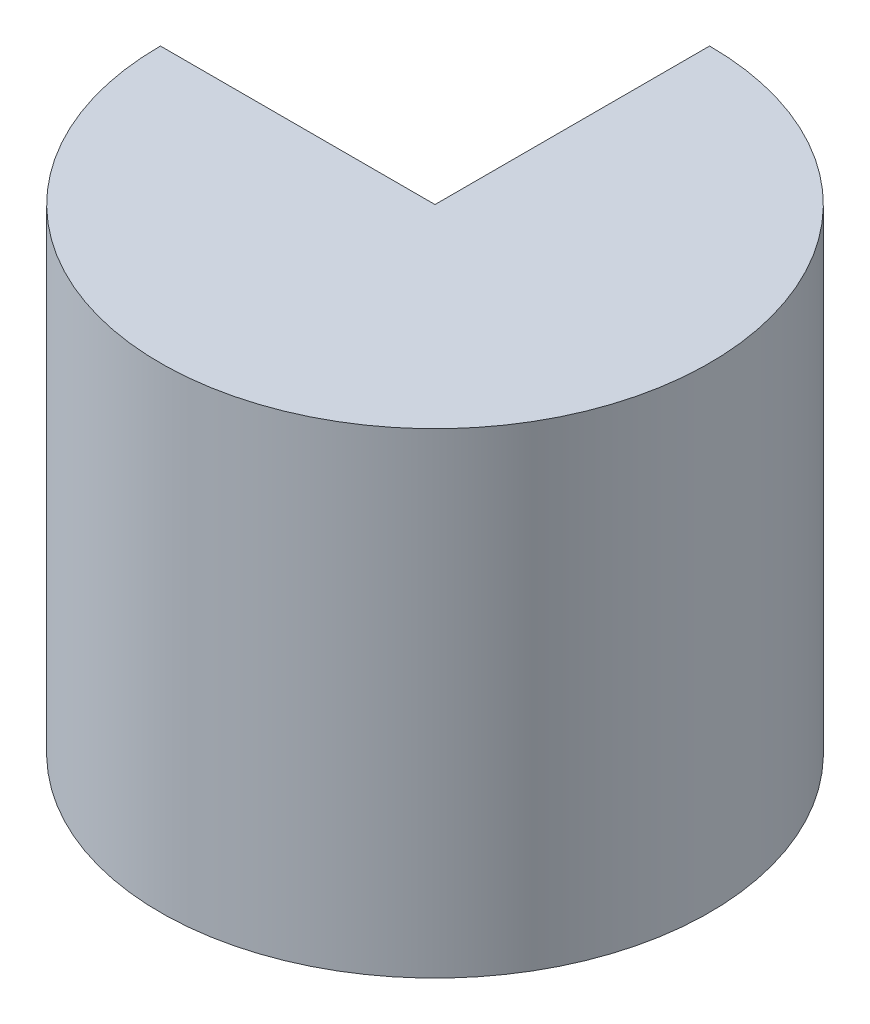
ISO-10303-21;
HEADER;
FILE_DESCRIPTION(('STEP AP214'),'2;1');
FILE_NAME('part.step','',(''),(''),'','','');
FILE_SCHEMA(('AUTOMOTIVE_DESIGN { 1 0 10303 214 1 1 1 1 }'));
ENDSEC;
DATA;
#1=APPLICATION_CONTEXT('core data for automotive mechanical design processes');
#2=APPLICATION_PROTOCOL_DEFINITION('international standard','automotive_design',2000,#1);
#3=PRODUCT_CONTEXT('',#1,'mechanical');
#4=PRODUCT('Part','Part','',(#3));
#5=PRODUCT_RELATED_PRODUCT_CATEGORY('part','',(#4));
#6=PRODUCT_DEFINITION_FORMATION('','',#4);
#7=PRODUCT_DEFINITION_CONTEXT('part definition',#1,'design');
#8=PRODUCT_DEFINITION('design','',#6,#7);
#9=PRODUCT_DEFINITION_SHAPE('','',#8);
#10=(LENGTH_UNIT() NAMED_UNIT(*) SI_UNIT(.MILLI.,.METRE.));
#11=(NAMED_UNIT(*) PLANE_ANGLE_UNIT() SI_UNIT($,.RADIAN.));
#12=(NAMED_UNIT(*) SI_UNIT($,.STERADIAN.) SOLID_ANGLE_UNIT());
#13=UNCERTAINTY_MEASURE_WITH_UNIT(LENGTH_MEASURE(1.E-05),#10,'distance_accuracy_value','');
#14=(GEOMETRIC_REPRESENTATION_CONTEXT(3) GLOBAL_UNCERTAINTY_ASSIGNED_CONTEXT((#13)) GLOBAL_UNIT_ASSIGNED_CONTEXT((#10,
#11,#12)) REPRESENTATION_CONTEXT('',''));
#15=CARTESIAN_POINT('',(0.,0.,0.));
#16=DIRECTION('',(0.,0.,1.));
#17=DIRECTION('',(1.,0.,0.));
#18=AXIS2_PLACEMENT_3D('',#15,#16,#17);
#19=CARTESIAN_POINT('',(-25.654,45.0234349741081,-2.68711386800045E-13));
#20=DIRECTION('',(0.,-1.,0.));
#21=DIRECTION('',(0.,0.,-1.));
#22=AXIS2_PLACEMENT_3D('',#19,#20,#21);
#23=PLANE('',#22);
#24=CARTESIAN_POINT('',(0.,45.0234349741081,0.));
#25=DIRECTION('',(0.,1.,0.));
#26=DIRECTION('',(0.,0.,1.));
#27=AXIS2_PLACEMENT_3D('',#24,#25,#26);
#28=CIRCLE('',#27,25.654);
#29=CARTESIAN_POINT('',(-25.654,45.0234349741081,-2.68711386800045E-13));
#30=VERTEX_POINT('',#29);
#31=CARTESIAN_POINT('',(0.,45.0234349741081,-25.654));
#32=VERTEX_POINT('',#31);
#33=EDGE_CURVE('E11',#30,#32,#28,.T.);
#34=ORIENTED_EDGE('',*,*,#33,.T.);
#35=DIRECTION('',(0.,0.,1.));
#36=VECTOR('',#35,1.);
#37=CARTESIAN_POINT('',(0.,45.0234349741081,-25.654));
#38=LINE('',#37,#36);
#39=CARTESIAN_POINT('',(0.,45.0234349741081,0.));
#40=VERTEX_POINT('',#39);
#41=EDGE_CURVE('E53',#32,#40,#38,.T.);
#42=ORIENTED_EDGE('',*,*,#41,.T.);
#43=DIRECTION('',(1.,0.,0.));
#44=VECTOR('',#43,1.);
#45=CARTESIAN_POINT('',(-25.654,45.0234349741081,-2.68711386800045E-13));
#46=LINE('',#45,#44);
#47=EDGE_CURVE('E88',#30,#40,#46,.T.);
#48=ORIENTED_EDGE('',*,*,#47,.F.);
#49=EDGE_LOOP('',(#34,#42,#48));
#50=FACE_BOUND('',#49,.T.);
#51=ADVANCED_FACE('F39',(#50),#23,.F.);
#52=CARTESIAN_POINT('',(0.,45.0234349741081,0.));
#53=DIRECTION('',(0.,1.,0.));
#54=DIRECTION('',(0.,0.,1.));
#55=AXIS2_PLACEMENT_3D('',#52,#53,#54);
#56=CYLINDRICAL_SURFACE('',#55,25.654);
#57=CARTESIAN_POINT('',(0.,0.573434974108077,0.));
#58=DIRECTION('',(0.,1.,0.));
#59=DIRECTION('',(0.,0.,1.));
#60=AXIS2_PLACEMENT_3D('',#57,#58,#59);
#61=CIRCLE('',#60,25.654);
#62=CARTESIAN_POINT('',(-25.654,0.573434974108077,-2.68711386800045E-13));
#63=VERTEX_POINT('',#62);
#64=CARTESIAN_POINT('',(0.,0.573434974108077,-25.654));
#65=VERTEX_POINT('',#64);
#66=EDGE_CURVE('E47',#63,#65,#61,.T.);
#67=ORIENTED_EDGE('',*,*,#66,.T.);
#68=DIRECTION('',(0.,1.,0.));
#69=VECTOR('',#68,1.);
#70=CARTESIAN_POINT('',(0.,45.0234349741081,-25.654));
#71=LINE('',#70,#69);
#72=EDGE_CURVE('E83',#65,#32,#71,.T.);
#73=ORIENTED_EDGE('',*,*,#72,.T.);
#74=ORIENTED_EDGE('',*,*,#33,.F.);
#75=DIRECTION('',(0.,1.,0.));
#76=VECTOR('',#75,1.);
#77=CARTESIAN_POINT('',(-25.654,45.0234349741081,-2.68711386800045E-13));
#78=LINE('',#77,#76);
#79=EDGE_CURVE('E86',#63,#30,#78,.T.);
#80=ORIENTED_EDGE('',*,*,#79,.F.);
#81=EDGE_LOOP('',(#67,#73,#74,#80));
#82=FACE_BOUND('',#81,.T.);
#83=ADVANCED_FACE('F85',(#82),#56,.T.);
#84=CARTESIAN_POINT('',(-3.17500000000001,0.57343497410807,0.));
#85=DIRECTION('',(0.,1.,0.));
#86=DIRECTION('',(0.,0.,1.));
#87=AXIS2_PLACEMENT_3D('',#84,#85,#86);
#88=PLANE('',#87);
#89=DIRECTION('',(-1.,0.,0.));
#90=VECTOR('',#89,1.);
#91=CARTESIAN_POINT('',(-3.17500000000001,0.57343497410807,0.));
#92=LINE('',#91,#90);
#93=CARTESIAN_POINT('',(0.,0.57343497410807,0.));
#94=VERTEX_POINT('',#93);
#95=EDGE_CURVE('E78',#94,#63,#92,.T.);
#96=ORIENTED_EDGE('',*,*,#95,.F.);
#97=DIRECTION('',(0.,0.,-1.));
#98=VECTOR('',#97,1.);
#99=CARTESIAN_POINT('',(0.,0.57343497410807,-3.17500000000001));
#100=LINE('',#99,#98);
#101=EDGE_CURVE('E75',#94,#65,#100,.T.);
#102=ORIENTED_EDGE('',*,*,#101,.T.);
#103=ORIENTED_EDGE('',*,*,#66,.F.);
#104=EDGE_LOOP('',(#96,#102,#103));
#105=FACE_BOUND('',#104,.T.);
#106=ADVANCED_FACE('F77',(#105),#88,.F.);
#107=CARTESIAN_POINT('',(0.,0.,0.));
#108=DIRECTION('',(0.,0.,1.));
#109=DIRECTION('',(1.,0.,0.));
#110=AXIS2_PLACEMENT_3D('',#107,#108,#109);
#111=PLANE('',#110);
#112=DIRECTION('',(0.,-1.,0.));
#113=VECTOR('',#112,1.);
#114=CARTESIAN_POINT('',(0.,45.0234349741081,0.));
#115=LINE('',#114,#113);
#116=EDGE_CURVE('E93',#40,#94,#115,.T.);
#117=ORIENTED_EDGE('',*,*,#116,.T.);
#118=ORIENTED_EDGE('',*,*,#95,.T.);
#119=ORIENTED_EDGE('',*,*,#79,.T.);
#120=ORIENTED_EDGE('',*,*,#47,.T.);
#121=EDGE_LOOP('',(#117,#118,#119,#120));
#122=FACE_BOUND('',#121,.T.);
#123=ADVANCED_FACE('F104',(#122),#111,.F.);
#124=CARTESIAN_POINT('',(0.,0.,0.));
#125=DIRECTION('',(-1.,0.,0.));
#126=DIRECTION('',(0.,0.,1.));
#127=AXIS2_PLACEMENT_3D('',#124,#125,#126);
#128=PLANE('',#127);
#129=ORIENTED_EDGE('',*,*,#116,.F.);
#130=ORIENTED_EDGE('',*,*,#41,.F.);
#131=ORIENTED_EDGE('',*,*,#72,.F.);
#132=ORIENTED_EDGE('',*,*,#101,.F.);
#133=EDGE_LOOP('',(#129,#130,#131,#132));
#134=FACE_BOUND('',#133,.T.);
#135=ADVANCED_FACE('F89',(#134),#128,.T.);
#136=CLOSED_SHELL('',(#51,#83,#106,#123,#135));
#137=MANIFOLD_SOLID_BREP('B2',#136);
#138=ADVANCED_BREP_SHAPE_REPRESENTATION('',(#18,#137),#14);
#139=SHAPE_DEFINITION_REPRESENTATION(#9,#138);
ENDSEC;
END-ISO-10303-21;
